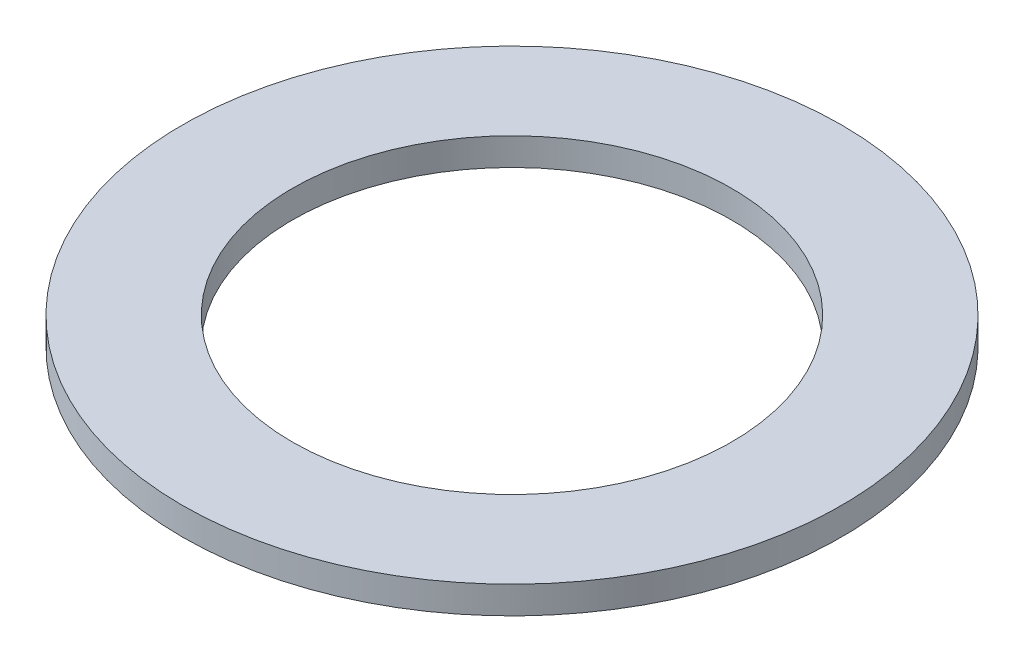
ISO-10303-21;
HEADER;
FILE_DESCRIPTION(('STEP AP214'),'2;1');
FILE_NAME('part.step','',(''),(''),'','','');
FILE_SCHEMA(('AUTOMOTIVE_DESIGN { 1 0 10303 214 1 1 1 1 }'));
ENDSEC;
DATA;
#1=APPLICATION_CONTEXT('core data for automotive mechanical design processes');
#2=APPLICATION_PROTOCOL_DEFINITION('international standard','automotive_design',2000,#1);
#3=PRODUCT_CONTEXT('',#1,'mechanical');
#4=PRODUCT('Part','Part','',(#3));
#5=PRODUCT_RELATED_PRODUCT_CATEGORY('part','',(#4));
#6=PRODUCT_DEFINITION_FORMATION('','',#4);
#7=PRODUCT_DEFINITION_CONTEXT('part definition',#1,'design');
#8=PRODUCT_DEFINITION('design','',#6,#7);
#9=PRODUCT_DEFINITION_SHAPE('','',#8);
#10=(LENGTH_UNIT() NAMED_UNIT(*) SI_UNIT(.MILLI.,.METRE.));
#11=(NAMED_UNIT(*) PLANE_ANGLE_UNIT() SI_UNIT($,.RADIAN.));
#12=(NAMED_UNIT(*) SI_UNIT($,.STERADIAN.) SOLID_ANGLE_UNIT());
#13=UNCERTAINTY_MEASURE_WITH_UNIT(LENGTH_MEASURE(1.E-05),#10,'distance_accuracy_value','');
#14=(GEOMETRIC_REPRESENTATION_CONTEXT(3) GLOBAL_UNCERTAINTY_ASSIGNED_CONTEXT((#13)) GLOBAL_UNIT_ASSIGNED_CONTEXT((#10,
#11,#12)) REPRESENTATION_CONTEXT('',''));
#15=CARTESIAN_POINT('',(0.,0.,0.));
#16=DIRECTION('',(0.,0.,1.));
#17=DIRECTION('',(1.,0.,0.));
#18=AXIS2_PLACEMENT_3D('',#15,#16,#17);
#19=CARTESIAN_POINT('',(0.,5.,0.));
#20=DIRECTION('',(0.,-1.,0.));
#21=DIRECTION('',(0.,0.,-1.));
#22=AXIS2_PLACEMENT_3D('',#19,#20,#21);
#23=CYLINDRICAL_SURFACE('',#22,60.);
#24=CARTESIAN_POINT('',(0.,5.,0.));
#25=DIRECTION('',(0.,1.,0.));
#26=DIRECTION('',(0.,0.,1.));
#27=AXIS2_PLACEMENT_3D('',#24,#25,#26);
#28=CIRCLE('',#27,60.);
#29=CARTESIAN_POINT('',(0.,5.,60.));
#30=VERTEX_POINT('',#29);
#31=EDGE_CURVE('E10',#30,#30,#28,.T.);
#32=ORIENTED_EDGE('',*,*,#31,.F.);
#33=EDGE_LOOP('',(#32));
#34=FACE_BOUND('',#33,.T.);
#35=CARTESIAN_POINT('',(0.,0.,0.));
#36=DIRECTION('',(0.,1.,0.));
#37=DIRECTION('',(0.,0.,1.));
#38=AXIS2_PLACEMENT_3D('',#35,#36,#37);
#39=CIRCLE('',#38,60.);
#40=CARTESIAN_POINT('',(0.,0.,60.));
#41=VERTEX_POINT('',#40);
#42=EDGE_CURVE('E37',#41,#41,#39,.T.);
#43=ORIENTED_EDGE('',*,*,#42,.T.);
#44=EDGE_LOOP('',(#43));
#45=FACE_BOUND('',#44,.T.);
#46=ADVANCED_FACE('F40',(#34,#45),#23,.T.);
#47=CARTESIAN_POINT('',(0.,5.,0.));
#48=DIRECTION('',(0.,1.,0.));
#49=DIRECTION('',(0.,0.,1.));
#50=AXIS2_PLACEMENT_3D('',#47,#48,#49);
#51=PLANE('',#50);
#52=CARTESIAN_POINT('',(0.,5.,0.));
#53=DIRECTION('',(0.,1.,0.));
#54=DIRECTION('',(0.,0.,1.));
#55=AXIS2_PLACEMENT_3D('',#52,#53,#54);
#56=CIRCLE('',#55,40.);
#57=CARTESIAN_POINT('',(0.,5.,40.));
#58=VERTEX_POINT('',#57);
#59=EDGE_CURVE('E50',#58,#58,#56,.T.);
#60=ORIENTED_EDGE('',*,*,#59,.F.);
#61=EDGE_LOOP('',(#60));
#62=FACE_BOUND('',#61,.T.);
#63=ORIENTED_EDGE('',*,*,#31,.T.);
#64=EDGE_LOOP('',(#63));
#65=FACE_BOUND('',#64,.T.);
#66=ADVANCED_FACE('F59',(#62,#65),#51,.T.);
#67=CARTESIAN_POINT('',(0.,0.,0.));
#68=DIRECTION('',(0.,1.,0.));
#69=DIRECTION('',(0.,0.,1.));
#70=AXIS2_PLACEMENT_3D('',#67,#68,#69);
#71=PLANE('',#70);
#72=CARTESIAN_POINT('',(0.,0.,0.));
#73=DIRECTION('',(0.,1.,0.));
#74=DIRECTION('',(0.,0.,1.));
#75=AXIS2_PLACEMENT_3D('',#72,#73,#74);
#76=CIRCLE('',#75,40.);
#77=CARTESIAN_POINT('',(0.,0.,40.));
#78=VERTEX_POINT('',#77);
#79=EDGE_CURVE('E47',#78,#78,#76,.T.);
#80=ORIENTED_EDGE('',*,*,#79,.T.);
#81=EDGE_LOOP('',(#80));
#82=FACE_BOUND('',#81,.T.);
#83=ORIENTED_EDGE('',*,*,#42,.F.);
#84=EDGE_LOOP('',(#83));
#85=FACE_BOUND('',#84,.T.);
#86=ADVANCED_FACE('F58',(#82,#85),#71,.F.);
#87=CARTESIAN_POINT('',(0.,5.,0.));
#88=DIRECTION('',(0.,-1.,0.));
#89=DIRECTION('',(0.,0.,-1.));
#90=AXIS2_PLACEMENT_3D('',#87,#88,#89);
#91=CYLINDRICAL_SURFACE('',#90,40.);
#92=ORIENTED_EDGE('',*,*,#59,.T.);
#93=EDGE_LOOP('',(#92));
#94=FACE_BOUND('',#93,.T.);
#95=ORIENTED_EDGE('',*,*,#79,.F.);
#96=EDGE_LOOP('',(#95));
#97=FACE_BOUND('',#96,.T.);
#98=ADVANCED_FACE('F54',(#94,#97),#91,.F.);
#99=CLOSED_SHELL('',(#46,#66,#86,#98));
#100=MANIFOLD_SOLID_BREP('B2',#99);
#101=ADVANCED_BREP_SHAPE_REPRESENTATION('',(#18,#100),#14);
#102=SHAPE_DEFINITION_REPRESENTATION(#9,#101);
ENDSEC;
END-ISO-10303-21;
